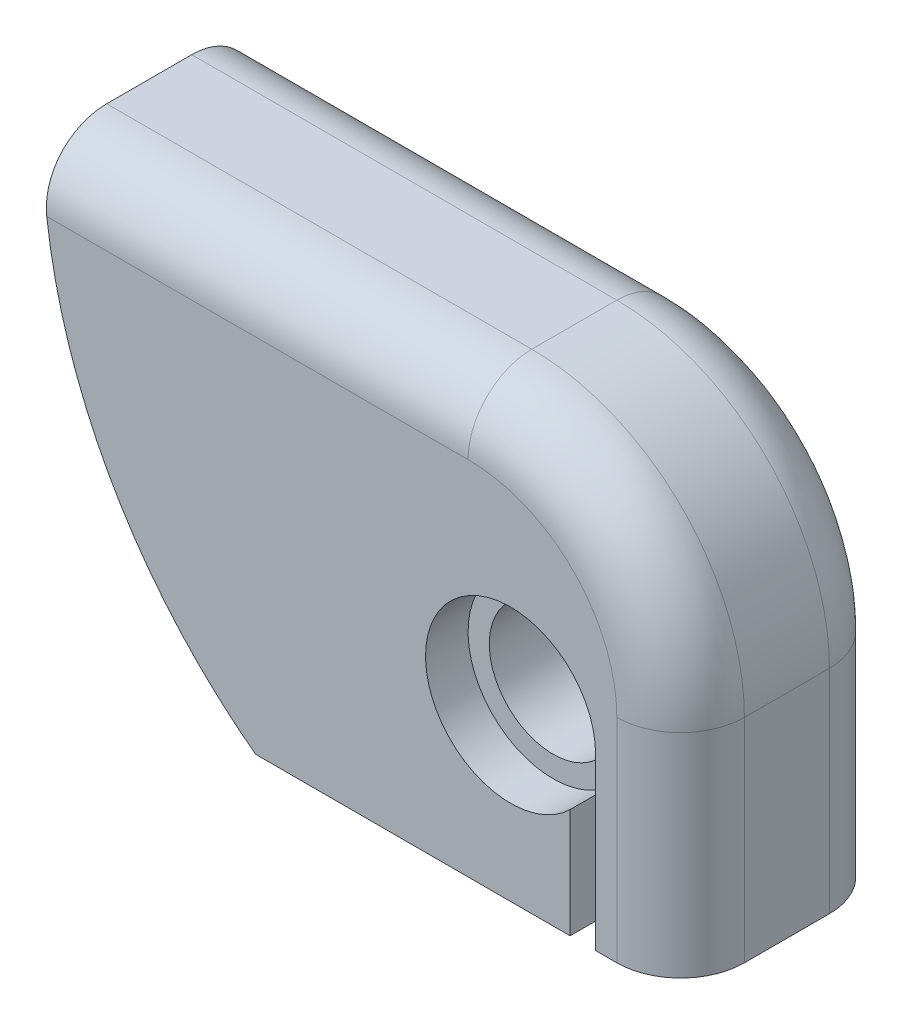
ISO-10303-21;
HEADER;
FILE_DESCRIPTION(('STEP AP214'),'2;1');
FILE_NAME('part.step','',(''),(''),'','','');
FILE_SCHEMA(('AUTOMOTIVE_DESIGN { 1 0 10303 214 1 1 1 1 }'));
ENDSEC;
DATA;
#1=APPLICATION_CONTEXT('core data for automotive mechanical design processes');
#2=APPLICATION_PROTOCOL_DEFINITION('international standard','automotive_design',2000,#1);
#3=PRODUCT_CONTEXT('',#1,'mechanical');
#4=PRODUCT('Part','Part','',(#3));
#5=PRODUCT_RELATED_PRODUCT_CATEGORY('part','',(#4));
#6=PRODUCT_DEFINITION_FORMATION('','',#4);
#7=PRODUCT_DEFINITION_CONTEXT('part definition',#1,'design');
#8=PRODUCT_DEFINITION('design','',#6,#7);
#9=PRODUCT_DEFINITION_SHAPE('','',#8);
#10=(LENGTH_UNIT() NAMED_UNIT(*) SI_UNIT(.MILLI.,.METRE.));
#11=(NAMED_UNIT(*) PLANE_ANGLE_UNIT() SI_UNIT($,.RADIAN.));
#12=(NAMED_UNIT(*) SI_UNIT($,.STERADIAN.) SOLID_ANGLE_UNIT());
#13=UNCERTAINTY_MEASURE_WITH_UNIT(LENGTH_MEASURE(1.E-05),#10,'distance_accuracy_value','');
#14=(GEOMETRIC_REPRESENTATION_CONTEXT(3) GLOBAL_UNCERTAINTY_ASSIGNED_CONTEXT((#13)) GLOBAL_UNIT_ASSIGNED_CONTEXT((#10,
#11,#12)) REPRESENTATION_CONTEXT('',''));
#15=CARTESIAN_POINT('',(0.,0.,0.));
#16=DIRECTION('',(0.,0.,1.));
#17=DIRECTION('',(1.,0.,0.));
#18=AXIS2_PLACEMENT_3D('',#15,#16,#17);
#19=CARTESIAN_POINT('',(-2.49999999999999,10.,2.5));
#20=DIRECTION('',(0.,0.,1.));
#21=DIRECTION('',(1.,0.,0.));
#22=AXIS2_PLACEMENT_3D('',#19,#20,#21);
#23=PLANE('',#22);
#24=DIRECTION('',(1.,0.,0.));
#25=VECTOR('',#24,1.);
#26=CARTESIAN_POINT('',(0.,0.,2.5));
#27=LINE('',#26,#25);
#28=CARTESIAN_POINT('',(-2.,0.,2.5));
#29=VERTEX_POINT('',#28);
#30=CARTESIAN_POINT('',(-1.5,0.,2.5));
#31=VERTEX_POINT('',#30);
#32=EDGE_CURVE('E229',#29,#31,#27,.T.);
#33=ORIENTED_EDGE('',*,*,#32,.T.);
#34=DIRECTION('',(0.,1.,0.));
#35=VECTOR('',#34,1.);
#36=CARTESIAN_POINT('',(-1.5,5.,2.5));
#37=LINE('',#36,#35);
#38=CARTESIAN_POINT('',(-1.5,5.,2.5));
#39=VERTEX_POINT('',#38);
#40=EDGE_CURVE('E253',#31,#39,#37,.T.);
#41=ORIENTED_EDGE('',*,*,#40,.T.);
#42=CARTESIAN_POINT('',(-5.,5.,2.5));
#43=DIRECTION('',(0.,0.,1.));
#44=DIRECTION('',(1.,0.,0.));
#45=AXIS2_PLACEMENT_3D('',#42,#43,#44);
#46=CIRCLE('',#45,3.5);
#47=CARTESIAN_POINT('',(-5.,8.5,2.5));
#48=VERTEX_POINT('',#47);
#49=EDGE_CURVE('E251',#39,#48,#46,.T.);
#50=ORIENTED_EDGE('',*,*,#49,.T.);
#51=DIRECTION('',(-1.,0.,0.));
#52=VECTOR('',#51,1.);
#53=CARTESIAN_POINT('',(-15.,8.5,2.5));
#54=LINE('',#53,#52);
#55=CARTESIAN_POINT('',(-14.9096736459909,8.5,2.5));
#56=VERTEX_POINT('',#55);
#57=EDGE_CURVE('E245',#48,#56,#54,.T.);
#58=ORIENTED_EDGE('',*,*,#57,.T.);
#59=CARTESIAN_POINT('',(-2.49999999999999,10.,2.5));
#60=DIRECTION('',(0.,0.,1.));
#61=DIRECTION('',(1.,0.,0.));
#62=AXIS2_PLACEMENT_3D('',#59,#60,#61);
#63=CIRCLE('',#62,12.5);
#64=CARTESIAN_POINT('',(-10.,0.,2.5));
#65=VERTEX_POINT('',#64);
#66=EDGE_CURVE('E228',#56,#65,#63,.T.);
#67=ORIENTED_EDGE('',*,*,#66,.T.);
#68=CARTESIAN_POINT('',(-2.6,0.,2.5));
#69=VERTEX_POINT('',#68);
#70=EDGE_CURVE('E225',#65,#69,#27,.T.);
#71=ORIENTED_EDGE('',*,*,#70,.T.);
#72=DIRECTION('',(0.,-1.,0.));
#73=VECTOR('',#72,1.);
#74=CARTESIAN_POINT('',(-2.6,-3.09530130898683,2.5));
#75=LINE('',#74,#73);
#76=CARTESIAN_POINT('',(-2.6,2.57171431429143,2.5));
#77=VERTEX_POINT('',#76);
#78=EDGE_CURVE('E170',#77,#69,#75,.T.);
#79=ORIENTED_EDGE('',*,*,#78,.F.);
#80=CARTESIAN_POINT('',(-4.,4.,2.5));
#81=DIRECTION('',(0.,0.,1.));
#82=DIRECTION('',(1.,0.,0.));
#83=AXIS2_PLACEMENT_3D('',#80,#81,#82);
#84=CIRCLE('',#83,2.);
#85=CARTESIAN_POINT('',(-2.,4.,2.5));
#86=VERTEX_POINT('',#85);
#87=EDGE_CURVE('E180',#86,#77,#84,.T.);
#88=ORIENTED_EDGE('',*,*,#87,.F.);
#89=DIRECTION('',(0.,-1.,0.));
#90=VECTOR('',#89,1.);
#91=CARTESIAN_POINT('',(-2.,-3.09530130898683,2.5));
#92=LINE('',#91,#90);
#93=EDGE_CURVE('E155',#86,#29,#92,.T.);
#94=ORIENTED_EDGE('',*,*,#93,.T.);
#95=EDGE_LOOP('',(#33,#41,#50,#58,#67,#71,#79,#88,#94));
#96=FACE_BOUND('',#95,.T.);
#97=ADVANCED_FACE('F32',(#96),#23,.T.);
#98=CARTESIAN_POINT('',(0.,0.,2.5));
#99=DIRECTION('',(0.,1.,0.));
#100=DIRECTION('',(-1.,0.,0.));
#101=AXIS2_PLACEMENT_3D('',#98,#99,#100);
#102=PLANE('',#101);
#103=DIRECTION('',(0.,0.,-1.));
#104=VECTOR('',#103,1.);
#105=CARTESIAN_POINT('',(0.,0.,2.5));
#106=LINE('',#105,#104);
#107=CARTESIAN_POINT('',(0.,0.,1.));
#108=VERTEX_POINT('',#107);
#109=CARTESIAN_POINT('',(0.,0.,-1.));
#110=VERTEX_POINT('',#109);
#111=EDGE_CURVE('E242',#108,#110,#106,.T.);
#112=ORIENTED_EDGE('',*,*,#111,.F.);
#113=CARTESIAN_POINT('',(-1.5,0.,1.));
#114=DIRECTION('',(0.,1.,0.));
#115=DIRECTION('',(-1.,0.,0.));
#116=AXIS2_PLACEMENT_3D('',#113,#114,#115);
#117=CIRCLE('',#116,1.5);
#118=EDGE_CURVE('E262',#108,#31,#117,.F.);
#119=ORIENTED_EDGE('',*,*,#118,.T.);
#120=ORIENTED_EDGE('',*,*,#32,.F.);
#121=DIRECTION('',(0.,0.,1.));
#122=VECTOR('',#121,1.);
#123=CARTESIAN_POINT('',(-2.,0.,1.5));
#124=LINE('',#123,#122);
#125=CARTESIAN_POINT('',(-2.,0.,1.5));
#126=VERTEX_POINT('',#125);
#127=EDGE_CURVE('E184',#126,#29,#124,.T.);
#128=ORIENTED_EDGE('',*,*,#127,.F.);
#129=DIRECTION('',(1.,0.,0.));
#130=VECTOR('',#129,1.);
#131=CARTESIAN_POINT('',(-3.25866302740411,0.,1.5));
#132=LINE('',#131,#130);
#133=CARTESIAN_POINT('',(-2.6,0.,1.5));
#134=VERTEX_POINT('',#133);
#135=EDGE_CURVE('E161',#134,#126,#132,.T.);
#136=ORIENTED_EDGE('',*,*,#135,.F.);
#137=DIRECTION('',(0.,0.,1.));
#138=VECTOR('',#137,1.);
#139=CARTESIAN_POINT('',(-2.6,0.,1.5));
#140=LINE('',#139,#138);
#141=EDGE_CURVE('E187',#134,#69,#140,.T.);
#142=ORIENTED_EDGE('',*,*,#141,.T.);
#143=ORIENTED_EDGE('',*,*,#70,.F.);
#144=DIRECTION('',(0.,0.,-1.));
#145=VECTOR('',#144,1.);
#146=CARTESIAN_POINT('',(-10.,0.,2.5));
#147=LINE('',#146,#145);
#148=CARTESIAN_POINT('',(-10.,0.,-2.5));
#149=VERTEX_POINT('',#148);
#150=EDGE_CURVE('E231',#65,#149,#147,.T.);
#151=ORIENTED_EDGE('',*,*,#150,.T.);
#152=DIRECTION('',(1.,0.,0.));
#153=VECTOR('',#152,1.);
#154=CARTESIAN_POINT('',(0.,0.,-2.5));
#155=LINE('',#154,#153);
#156=CARTESIAN_POINT('',(-2.6,0.,-2.5));
#157=VERTEX_POINT('',#156);
#158=EDGE_CURVE('E232',#149,#157,#155,.T.);
#159=ORIENTED_EDGE('',*,*,#158,.T.);
#160=DIRECTION('',(0.,0.,-1.));
#161=VECTOR('',#160,1.);
#162=CARTESIAN_POINT('',(-2.6,0.,-1.5));
#163=LINE('',#162,#161);
#164=CARTESIAN_POINT('',(-2.6,0.,-1.5));
#165=VERTEX_POINT('',#164);
#166=EDGE_CURVE('E211',#165,#157,#163,.T.);
#167=ORIENTED_EDGE('',*,*,#166,.F.);
#168=DIRECTION('',(1.,0.,0.));
#169=VECTOR('',#168,1.);
#170=CARTESIAN_POINT('',(-3.25866302740411,0.,-1.5));
#171=LINE('',#170,#169);
#172=CARTESIAN_POINT('',(-2.,0.,-1.5));
#173=VERTEX_POINT('',#172);
#174=EDGE_CURVE('E198',#165,#173,#171,.T.);
#175=ORIENTED_EDGE('',*,*,#174,.T.);
#176=DIRECTION('',(0.,0.,-1.));
#177=VECTOR('',#176,1.);
#178=CARTESIAN_POINT('',(-2.,0.,-1.5));
#179=LINE('',#178,#177);
#180=CARTESIAN_POINT('',(-2.,0.,-2.5));
#181=VERTEX_POINT('',#180);
#182=EDGE_CURVE('E201',#173,#181,#179,.T.);
#183=ORIENTED_EDGE('',*,*,#182,.T.);
#184=CARTESIAN_POINT('',(-1.5,0.,-2.5));
#185=VERTEX_POINT('',#184);
#186=EDGE_CURVE('E224',#181,#185,#155,.T.);
#187=ORIENTED_EDGE('',*,*,#186,.T.);
#188=CARTESIAN_POINT('',(-1.5,0.,-1.));
#189=DIRECTION('',(0.,1.,0.));
#190=DIRECTION('',(-1.,0.,0.));
#191=AXIS2_PLACEMENT_3D('',#188,#189,#190);
#192=CIRCLE('',#191,1.5);
#193=EDGE_CURVE('E260',#185,#110,#192,.F.);
#194=ORIENTED_EDGE('',*,*,#193,.T.);
#195=EDGE_LOOP('',(#112,#119,#120,#128,#136,#142,#143,#151,#159,#167,#175,#183,#187,#194));
#196=FACE_BOUND('',#195,.T.);
#197=ADVANCED_FACE('F308',(#196),#102,.F.);
#198=CARTESIAN_POINT('',(-4.,4.,-9.57106781186548));
#199=DIRECTION('',(0.,0.,1.));
#200=DIRECTION('',(1.,0.,0.));
#201=AXIS2_PLACEMENT_3D('',#198,#199,#200);
#202=CYLINDRICAL_SURFACE('',#201,1.5);
#203=CARTESIAN_POINT('',(-4.,4.,-1.5));
#204=DIRECTION('',(0.,0.,1.));
#205=DIRECTION('',(1.,0.,0.));
#206=AXIS2_PLACEMENT_3D('',#203,#204,#205);
#207=CIRCLE('',#206,1.5);
#208=CARTESIAN_POINT('',(-2.5,4.,-1.5));
#209=VERTEX_POINT('',#208);
#210=EDGE_CURVE('E217',#209,#209,#207,.F.);
#211=CARTESIAN_POINT('',(-4.,4.,1.5));
#212=DIRECTION('',(0.,0.,1.));
#213=DIRECTION('',(1.,0.,0.));
#214=AXIS2_PLACEMENT_3D('',#211,#212,#213);
#215=CIRCLE('',#214,1.5);
#216=CARTESIAN_POINT('',(-2.5,4.,1.5));
#217=VERTEX_POINT('',#216);
#218=EDGE_CURVE('E186',#217,#217,#215,.F.);
#219=CARTESIAN_POINT('',(-2.5,4.,-1.5));
#220=CARTESIAN_POINT('',(-2.5,4.,-1.46875));
#221=CARTESIAN_POINT('',(-2.5,4.,-1.4375));
#222=CARTESIAN_POINT('',(-2.5,4.,-1.375));
#223=CARTESIAN_POINT('',(-2.5,4.,-1.34375));
#224=CARTESIAN_POINT('',(-2.5,4.,-1.28125));
#225=CARTESIAN_POINT('',(-2.5,4.,-1.25));
#226=CARTESIAN_POINT('',(-2.5,4.,-1.1875));
#227=CARTESIAN_POINT('',(-2.5,4.,-1.15625));
#228=CARTESIAN_POINT('',(-2.5,4.,-1.09375));
#229=CARTESIAN_POINT('',(-2.5,4.,-1.0625));
#230=CARTESIAN_POINT('',(-2.5,4.,-1.));
#231=CARTESIAN_POINT('',(-2.5,4.,-0.968750000000001));
#232=CARTESIAN_POINT('',(-2.5,4.,-0.906250000000001));
#233=CARTESIAN_POINT('',(-2.5,4.,-0.875000000000001));
#234=CARTESIAN_POINT('',(-2.5,4.,-0.812500000000001));
#235=CARTESIAN_POINT('',(-2.5,4.,-0.781250000000001));
#236=CARTESIAN_POINT('',(-2.5,4.,-0.718750000000001));
#237=CARTESIAN_POINT('',(-2.5,4.,-0.687500000000002));
#238=CARTESIAN_POINT('',(-2.5,4.,-0.625000000000002));
#239=CARTESIAN_POINT('',(-2.5,4.,-0.593750000000002));
#240=CARTESIAN_POINT('',(-2.5,4.,-0.531250000000002));
#241=CARTESIAN_POINT('',(-2.5,4.,-0.500000000000002));
#242=CARTESIAN_POINT('',(-2.5,4.,-0.437500000000002));
#243=CARTESIAN_POINT('',(-2.5,4.,-0.406250000000002));
#244=CARTESIAN_POINT('',(-2.5,4.,-0.343750000000002));
#245=CARTESIAN_POINT('',(-2.5,4.,-0.312500000000002));
#246=CARTESIAN_POINT('',(-2.5,4.,-0.250000000000002));
#247=CARTESIAN_POINT('',(-2.5,4.,-0.218750000000002));
#248=CARTESIAN_POINT('',(-2.5,4.,-0.156250000000002));
#249=CARTESIAN_POINT('',(-2.5,4.,-0.125000000000002));
#250=CARTESIAN_POINT('',(-2.5,4.,-0.0625000000000018));
#251=CARTESIAN_POINT('',(-2.5,4.,-0.0312500000000018));
#252=CARTESIAN_POINT('',(-2.5,4.,0.0312499999999983));
#253=CARTESIAN_POINT('',(-2.5,4.,0.0624999999999983));
#254=CARTESIAN_POINT('',(-2.5,4.,0.124999999999998));
#255=CARTESIAN_POINT('',(-2.5,4.,0.156249999999998));
#256=CARTESIAN_POINT('',(-2.5,4.,0.218749999999998));
#257=CARTESIAN_POINT('',(-2.5,4.,0.249999999999999));
#258=CARTESIAN_POINT('',(-2.5,4.,0.312499999999999));
#259=CARTESIAN_POINT('',(-2.5,4.,0.343749999999999));
#260=CARTESIAN_POINT('',(-2.5,4.,0.406249999999999));
#261=CARTESIAN_POINT('',(-2.5,4.,0.437499999999999));
#262=CARTESIAN_POINT('',(-2.5,4.,0.499999999999998));
#263=CARTESIAN_POINT('',(-2.5,4.,0.531249999999998));
#264=CARTESIAN_POINT('',(-2.5,4.,0.593749999999997));
#265=CARTESIAN_POINT('',(-2.5,4.,0.624999999999997));
#266=CARTESIAN_POINT('',(-2.5,4.,0.687499999999997));
#267=CARTESIAN_POINT('',(-2.5,4.,0.718749999999997));
#268=CARTESIAN_POINT('',(-2.5,4.,0.781249999999997));
#269=CARTESIAN_POINT('',(-2.5,4.,0.812499999999997));
#270=CARTESIAN_POINT('',(-2.5,4.,0.874999999999997));
#271=CARTESIAN_POINT('',(-2.5,4.,0.906249999999997));
#272=CARTESIAN_POINT('',(-2.5,4.,0.968749999999997));
#273=CARTESIAN_POINT('',(-2.5,4.,0.999999999999997));
#274=CARTESIAN_POINT('',(-2.5,4.,1.0625));
#275=CARTESIAN_POINT('',(-2.5,4.,1.09375));
#276=CARTESIAN_POINT('',(-2.5,4.,1.15625));
#277=CARTESIAN_POINT('',(-2.5,4.,1.1875));
#278=CARTESIAN_POINT('',(-2.5,4.,1.25));
#279=CARTESIAN_POINT('',(-2.5,4.,1.28125));
#280=CARTESIAN_POINT('',(-2.5,4.,1.34375));
#281=CARTESIAN_POINT('',(-2.5,4.,1.375));
#282=CARTESIAN_POINT('',(-2.5,4.,1.4375));
#283=CARTESIAN_POINT('',(-2.5,4.,1.46875));
#284=CARTESIAN_POINT('',(-2.5,4.,1.5));
#285=B_SPLINE_CURVE_WITH_KNOTS('',3,(#219,#220,#221,#222,#223,#224,#225,#226,#227,#228,#229,
#230,#231,#232,#233,#234,#235,#236,#237,#238,#239,#240,#241,#242,#243,#244,#245,#246,#247,#248,
#249,#250,#251,#252,#253,#254,#255,#256,#257,#258,#259,#260,#261,#262,#263,#264,#265,#266,#267,
#268,#269,#270,#271,#272,#273,#274,#275,#276,#277,#278,#279,#280,#281,#282,#283,#284),
.UNSPECIFIED.,.F.,.F.,(4,2,2,2,2,2,2,2,2,2,2,2,2,2,2,2,2,2,2,2,2,2,2,2,2,2,2,2,2,2,2,2,4),(0.,
0.0937500000000001,0.1875,0.28125,0.375,0.46875,0.5625,0.656250000000001,0.750000000000001,
0.843749999999999,0.937499999999999,1.03125,1.125,1.21875,1.3125,1.40625,1.5,1.59375,1.6875,
1.78125,1.875,1.96875,2.0625,2.15625,2.25,2.34375,2.4375,2.53125,2.625,2.71875,2.8125,2.90625,
3.),.UNSPECIFIED.);
#286=EDGE_CURVE('BSEAM303',#209,#217,#285,.T.);
#287=ORIENTED_EDGE('',*,*,#210,.T.);
#288=ORIENTED_EDGE('',*,*,#218,.F.);
#289=ORIENTED_EDGE('',*,*,#286,.T.);
#290=ORIENTED_EDGE('',*,*,#286,.F.);
#291=EDGE_LOOP('',(#287,#289,#288,#290));
#292=FACE_BOUND('',#291,.T.);
#293=ADVANCED_FACE('F303',(#292),#202,.F.);
#294=CARTESIAN_POINT('',(0.,10.,2.5));
#295=DIRECTION('',(0.,-1.,0.));
#296=DIRECTION('',(1.,0.,0.));
#297=AXIS2_PLACEMENT_3D('',#294,#295,#296);
#298=PLANE('',#297);
#299=DIRECTION('',(0.,0.,1.));
#300=VECTOR('',#299,1.);
#301=CARTESIAN_POINT('',(-5.,10.,-9.57106781186548));
#302=LINE('',#301,#300);
#303=CARTESIAN_POINT('',(-5.,10.,-1.));
#304=VERTEX_POINT('',#303);
#305=CARTESIAN_POINT('',(-5.,10.,0.999999999999996));
#306=VERTEX_POINT('',#305);
#307=EDGE_CURVE('E218',#304,#306,#302,.T.);
#308=ORIENTED_EDGE('',*,*,#307,.F.);
#309=DIRECTION('',(-1.,0.,0.));
#310=VECTOR('',#309,1.);
#311=CARTESIAN_POINT('',(0.,10.,-1.));
#312=LINE('',#311,#310);
#313=CARTESIAN_POINT('',(-15.,10.,-1.));
#314=VERTEX_POINT('',#313);
#315=EDGE_CURVE('E270',#304,#314,#312,.T.);
#316=ORIENTED_EDGE('',*,*,#315,.T.);
#317=DIRECTION('',(0.,0.,-1.));
#318=VECTOR('',#317,1.);
#319=CARTESIAN_POINT('',(-15.,10.,2.5));
#320=LINE('',#319,#318);
#321=CARTESIAN_POINT('',(-15.,10.,1.));
#322=VERTEX_POINT('',#321);
#323=EDGE_CURVE('E239',#322,#314,#320,.T.);
#324=ORIENTED_EDGE('',*,*,#323,.F.);
#325=DIRECTION('',(-1.,0.,0.));
#326=VECTOR('',#325,1.);
#327=CARTESIAN_POINT('',(-5.,10.,1.));
#328=LINE('',#327,#326);
#329=EDGE_CURVE('E268',#322,#306,#328,.F.);
#330=ORIENTED_EDGE('',*,*,#329,.T.);
#331=EDGE_LOOP('',(#308,#316,#324,#330));
#332=FACE_BOUND('',#331,.T.);
#333=ADVANCED_FACE('F299',(#332),#298,.F.);
#334=CARTESIAN_POINT('',(-2.49999999999999,10.,-2.5));
#335=DIRECTION('',(0.,0.,1.));
#336=DIRECTION('',(1.,0.,0.));
#337=AXIS2_PLACEMENT_3D('',#334,#335,#336);
#338=PLANE('',#337);
#339=CARTESIAN_POINT('',(-2.49999999999999,10.,-2.5));
#340=DIRECTION('',(0.,0.,1.));
#341=DIRECTION('',(1.,0.,0.));
#342=AXIS2_PLACEMENT_3D('',#339,#340,#341);
#343=CIRCLE('',#342,12.5);
#344=CARTESIAN_POINT('',(-14.9096736459909,8.5,-2.5));
#345=VERTEX_POINT('',#344);
#346=EDGE_CURVE('E235',#345,#149,#343,.T.);
#347=ORIENTED_EDGE('',*,*,#346,.F.);
#348=DIRECTION('',(-1.,0.,0.));
#349=VECTOR('',#348,1.);
#350=CARTESIAN_POINT('',(-2.49999999999999,8.5,-2.5));
#351=LINE('',#350,#349);
#352=CARTESIAN_POINT('',(-5.,8.5,-2.5));
#353=VERTEX_POINT('',#352);
#354=EDGE_CURVE('E11',#345,#353,#351,.F.);
#355=ORIENTED_EDGE('',*,*,#354,.T.);
#356=CARTESIAN_POINT('',(-5.,5.,-2.5));
#357=DIRECTION('',(0.,0.,1.));
#358=DIRECTION('',(1.,0.,0.));
#359=AXIS2_PLACEMENT_3D('',#356,#357,#358);
#360=CIRCLE('',#359,3.5);
#361=CARTESIAN_POINT('',(-1.5,5.,-2.5));
#362=VERTEX_POINT('',#361);
#363=EDGE_CURVE('E48',#353,#362,#360,.F.);
#364=ORIENTED_EDGE('',*,*,#363,.T.);
#365=DIRECTION('',(0.,1.,0.));
#366=VECTOR('',#365,1.);
#367=CARTESIAN_POINT('',(-1.5,10.,-2.5));
#368=LINE('',#367,#366);
#369=EDGE_CURVE('E41',#362,#185,#368,.F.);
#370=ORIENTED_EDGE('',*,*,#369,.T.);
#371=ORIENTED_EDGE('',*,*,#186,.F.);
#372=DIRECTION('',(0.,-1.,0.));
#373=VECTOR('',#372,1.);
#374=CARTESIAN_POINT('',(-2.,-3.09530130898683,-2.5));
#375=LINE('',#374,#373);
#376=CARTESIAN_POINT('',(-2.,4.,-2.5));
#377=VERTEX_POINT('',#376);
#378=EDGE_CURVE('E202',#377,#181,#375,.T.);
#379=ORIENTED_EDGE('',*,*,#378,.F.);
#380=CARTESIAN_POINT('',(-4.,4.,-2.5));
#381=DIRECTION('',(0.,0.,1.));
#382=DIRECTION('',(1.,0.,0.));
#383=AXIS2_PLACEMENT_3D('',#380,#381,#382);
#384=CIRCLE('',#383,2.);
#385=CARTESIAN_POINT('',(-2.6,2.57171431429143,-2.5));
#386=VERTEX_POINT('',#385);
#387=EDGE_CURVE('E204',#377,#386,#384,.T.);
#388=ORIENTED_EDGE('',*,*,#387,.T.);
#389=DIRECTION('',(0.,-1.,0.));
#390=VECTOR('',#389,1.);
#391=CARTESIAN_POINT('',(-2.6,-3.09530130898683,-2.5));
#392=LINE('',#391,#390);
#393=EDGE_CURVE('E194',#386,#157,#392,.T.);
#394=ORIENTED_EDGE('',*,*,#393,.T.);
#395=ORIENTED_EDGE('',*,*,#158,.F.);
#396=EDGE_LOOP('',(#347,#355,#364,#370,#371,#379,#388,#394,#395));
#397=FACE_BOUND('',#396,.T.);
#398=ADVANCED_FACE('F297',(#397),#338,.F.);
#399=CARTESIAN_POINT('',(0.,0.,2.5));
#400=DIRECTION('',(-1.,0.,0.));
#401=DIRECTION('',(0.,0.,1.));
#402=AXIS2_PLACEMENT_3D('',#399,#400,#401);
#403=PLANE('',#402);
#404=DIRECTION('',(0.,0.,1.));
#405=VECTOR('',#404,1.);
#406=CARTESIAN_POINT('',(0.,5.,-9.57106781186548));
#407=LINE('',#406,#405);
#408=CARTESIAN_POINT('',(0.,5.,-1.));
#409=VERTEX_POINT('',#408);
#410=CARTESIAN_POINT('',(0.,5.,0.999999999999997));
#411=VERTEX_POINT('',#410);
#412=EDGE_CURVE('E221',#409,#411,#407,.T.);
#413=ORIENTED_EDGE('',*,*,#412,.T.);
#414=DIRECTION('',(0.,1.,0.));
#415=VECTOR('',#414,1.);
#416=CARTESIAN_POINT('',(0.,0.,1.));
#417=LINE('',#416,#415);
#418=EDGE_CURVE('E258',#411,#108,#417,.F.);
#419=ORIENTED_EDGE('',*,*,#418,.T.);
#420=ORIENTED_EDGE('',*,*,#111,.T.);
#421=DIRECTION('',(0.,1.,0.));
#422=VECTOR('',#421,1.);
#423=CARTESIAN_POINT('',(0.,0.,-1.));
#424=LINE('',#423,#422);
#425=EDGE_CURVE('E256',#110,#409,#424,.T.);
#426=ORIENTED_EDGE('',*,*,#425,.T.);
#427=EDGE_LOOP('',(#413,#419,#420,#426));
#428=FACE_BOUND('',#427,.T.);
#429=ADVANCED_FACE('F295',(#428),#403,.F.);
#430=CARTESIAN_POINT('',(-2.49999999999999,10.,2.5));
#431=DIRECTION('',(0.,0.,-1.));
#432=DIRECTION('',(-1.,0.,0.));
#433=AXIS2_PLACEMENT_3D('',#430,#431,#432);
#434=CYLINDRICAL_SURFACE('',#433,12.5);
#435=ORIENTED_EDGE('',*,*,#323,.T.);
#436=CARTESIAN_POINT('',(-15.,10.,-1.));
#437=CARTESIAN_POINT('',(-14.9999987694352,9.99999971856559,-1.04219611734056));
#438=CARTESIAN_POINT('',(-15.0000001383337,9.99821837072552,-1.08437202117825));
#439=CARTESIAN_POINT('',(-14.9999975848447,9.99111184095478,-1.16842213492557));
#440=CARTESIAN_POINT('',(-14.9999936627077,9.9857868268634,-1.21029635902878));
#441=CARTESIAN_POINT('',(-14.9999582652267,9.96454650154868,-1.33494553508898));
#442=CARTESIAN_POINT('',(-14.99990322288,9.94336576944003,-1.41688574305065));
#443=CARTESIAN_POINT('',(-14.9995249841696,9.88755048960332,-1.57604584856594));
#444=CARTESIAN_POINT('',(-14.999201656879,9.85290937740402,-1.65326342164607));
#445=CARTESIAN_POINT('',(-14.9979717340822,9.77116182017292,-1.80078277838428));
#446=CARTESIAN_POINT('',(-14.9970652399698,9.72405754291843,-1.87108576181547));
#447=CARTESIAN_POINT('',(-14.9942955177223,9.61876098275411,-2.00273422854891));
#448=CARTESIAN_POINT('',(-14.992432875184,9.56057550027521,-2.06408516506516));
#449=CARTESIAN_POINT('',(-14.9873719566865,9.43476009824233,-2.17614603928224));
#450=CARTESIAN_POINT('',(-14.9841735003202,9.3671289038276,-2.22685453828776));
#451=CARTESIAN_POINT('',(-14.9761287073568,9.22456936988384,-2.31607617854831));
#452=CARTESIAN_POINT('',(-14.9712862494252,9.14965849940385,-2.35461761604438));
#453=CARTESIAN_POINT('',(-14.9597418772903,8.99458381669196,-2.41859523729839));
#454=CARTESIAN_POINT('',(-14.9530408691311,8.91442257852451,-2.44403778954967));
#455=CARTESIAN_POINT('',(-14.9402624531277,8.77816027575061,-2.47505181424732));
#456=CARTESIAN_POINT('',(-14.9347078923701,8.7228405279878,-2.48440915124254));
#457=CARTESIAN_POINT('',(-14.9227894477094,8.61167154306447,-2.49688279478336));
#458=CARTESIAN_POINT('',(-14.9164267726422,8.55582320977304,-2.50000830906351));
#459=CARTESIAN_POINT('',(-14.9096736459909,8.5,-2.5));
#460=B_SPLINE_CURVE_WITH_KNOTS('',3,(#436,#437,#438,#439,#440,#441,#442,#443,#444,#445,#446,
#447,#448,#449,#450,#451,#452,#453,#454,#455,#456,#457,#458,#459),.UNSPECIFIED.,.F.,.F.,(4,2,2,
2,2,2,2,2,2,2,2,4),(0.,0.126510611846237,0.253015232174578,0.505613512698983,0.758335137402742,
1.01101283390123,1.26353596127422,1.51609320396737,1.76805868624971,2.01990155050728,
2.18870953177601,2.35726790800798),.UNSPECIFIED.);
#461=EDGE_CURVE('E280',#314,#345,#460,.T.);
#462=ORIENTED_EDGE('',*,*,#461,.T.);
#463=ORIENTED_EDGE('',*,*,#346,.T.);
#464=ORIENTED_EDGE('',*,*,#150,.F.);
#465=ORIENTED_EDGE('',*,*,#66,.F.);
#466=CARTESIAN_POINT('',(-14.9096736459909,8.5,2.5));
#467=CARTESIAN_POINT('',(-14.9147355629286,8.5418681377638,2.4999997315655));
#468=CARTESIAN_POINT('',(-14.9195807000652,8.583743057633,2.49824588592708));
#469=CARTESIAN_POINT('',(-14.9288187185416,8.66724869694066,2.49123619950866));
#470=CARTESIAN_POINT('',(-14.9332116004411,8.70887941668129,2.48598036306253));
#471=CARTESIAN_POINT('',(-14.9456709115546,8.83289013453353,2.46498937632729));
#472=CARTESIAN_POINT('',(-14.9530338577697,8.91452046056546,2.44403069883932));
#473=CARTESIAN_POINT('',(-14.9658550455073,9.0732728263069,2.38868256576928));
#474=CARTESIAN_POINT('',(-14.9713119345805,9.15039163268158,2.35428361010879));
#475=CARTESIAN_POINT('',(-14.980482090897,9.29784325688014,2.27299934140793));
#476=CARTESIAN_POINT('',(-14.9841957930538,9.36817776385851,2.22611714743202));
#477=CARTESIAN_POINT('',(-14.9901602690871,9.49977132576756,2.12138498938666));
#478=CARTESIAN_POINT('',(-14.9924164981829,9.56106355239243,2.06357698304008));
#479=CARTESIAN_POINT('',(-14.9958521308622,9.67314866532717,1.93849588425055));
#480=CARTESIAN_POINT('',(-14.9970312934113,9.72393919952064,1.87122067704967));
#481=CARTESIAN_POINT('',(-14.9986916525837,9.81363843738458,1.72899798621909));
#482=CARTESIAN_POINT('',(-14.9991715855331,9.85252552880988,1.65403687327518));
#483=CARTESIAN_POINT('',(-14.9997676640309,9.91717816284269,1.49867361485344));
#484=CARTESIAN_POINT('',(-14.999884009961,9.94295092651168,1.41827449136517));
#485=CARTESIAN_POINT('',(-14.9999804439447,9.97449695071047,1.28118820339051));
#486=CARTESIAN_POINT('',(-14.9999926427159,9.98405393913394,1.22534189799767));
#487=CARTESIAN_POINT('',(-15.0000000314911,9.99680525959181,1.11300471439247));
#488=CARTESIAN_POINT('',(-14.9999952445985,10.0000082249454,1.05651481581382));
#489=CARTESIAN_POINT('',(-15.,10.,1.));
#490=B_SPLINE_CURVE_WITH_KNOTS('',3,(#466,#467,#468,#469,#470,#471,#472,#473,#474,#475,#476,
#477,#478,#479,#480,#481,#482,#483,#484,#485,#486,#487,#488,#489),.UNSPECIFIED.,.F.,.F.,(4,2,2,
2,2,2,2,2,2,2,2,4),(0.,0.126443208411518,0.252886260343721,0.50537924863412,0.758051031981054,
1.01065974185111,1.26231739102248,1.51403134430088,1.76619964260538,2.01822894037389,
2.18786498761149,2.3572703891721),.UNSPECIFIED.);
#491=EDGE_CURVE('E273',#56,#322,#490,.T.);
#492=ORIENTED_EDGE('',*,*,#491,.T.);
#493=EDGE_LOOP('',(#435,#462,#463,#464,#465,#492));
#494=FACE_BOUND('',#493,.T.);
#495=ADVANCED_FACE('F289',(#494),#434,.T.);
#496=CARTESIAN_POINT('',(-5.,5.,-9.57106781186548));
#497=DIRECTION('',(0.,0.,1.));
#498=DIRECTION('',(1.,0.,0.));
#499=AXIS2_PLACEMENT_3D('',#496,#497,#498);
#500=CYLINDRICAL_SURFACE('',#499,5.);
#501=ORIENTED_EDGE('',*,*,#307,.T.);
#502=CARTESIAN_POINT('',(-5.,5.,1.));
#503=DIRECTION('',(0.,0.,1.));
#504=DIRECTION('',(1.,0.,0.));
#505=AXIS2_PLACEMENT_3D('',#502,#503,#504);
#506=CIRCLE('',#505,5.);
#507=EDGE_CURVE('E266',#306,#411,#506,.F.);
#508=ORIENTED_EDGE('',*,*,#507,.T.);
#509=ORIENTED_EDGE('',*,*,#412,.F.);
#510=CARTESIAN_POINT('',(-5.,5.,-0.999999999999997));
#511=DIRECTION('',(0.,0.,1.));
#512=DIRECTION('',(1.,0.,0.));
#513=AXIS2_PLACEMENT_3D('',#510,#511,#512);
#514=CIRCLE('',#513,5.);
#515=EDGE_CURVE('E264',#409,#304,#514,.T.);
#516=ORIENTED_EDGE('',*,*,#515,.T.);
#517=EDGE_LOOP('',(#501,#508,#509,#516));
#518=FACE_BOUND('',#517,.T.);
#519=ADVANCED_FACE('F294',(#518),#500,.T.);
#520=CARTESIAN_POINT('',(-3.25866302740411,-3.09530130898683,-1.5));
#521=DIRECTION('',(0.,0.,1.));
#522=DIRECTION('',(1.,0.,0.));
#523=AXIS2_PLACEMENT_3D('',#520,#521,#522);
#524=PLANE('',#523);
#525=DIRECTION('',(0.,-1.,0.));
#526=VECTOR('',#525,1.);
#527=CARTESIAN_POINT('',(-2.,-3.09530130898683,-1.5));
#528=LINE('',#527,#526);
#529=CARTESIAN_POINT('',(-2.,4.,-1.5));
#530=VERTEX_POINT('',#529);
#531=EDGE_CURVE('E191',#530,#173,#528,.T.);
#532=ORIENTED_EDGE('',*,*,#531,.T.);
#533=ORIENTED_EDGE('',*,*,#174,.F.);
#534=DIRECTION('',(0.,-1.,0.));
#535=VECTOR('',#534,1.);
#536=CARTESIAN_POINT('',(-2.6,-3.09530130898683,-1.5));
#537=LINE('',#536,#535);
#538=CARTESIAN_POINT('',(-2.6,2.57171431429143,-1.5));
#539=VERTEX_POINT('',#538);
#540=EDGE_CURVE('E196',#539,#165,#537,.T.);
#541=ORIENTED_EDGE('',*,*,#540,.F.);
#542=CARTESIAN_POINT('',(-4.,4.,-1.5));
#543=DIRECTION('',(0.,0.,1.));
#544=DIRECTION('',(1.,0.,0.));
#545=AXIS2_PLACEMENT_3D('',#542,#543,#544);
#546=CIRCLE('',#545,2.);
#547=EDGE_CURVE('E193',#530,#539,#546,.T.);
#548=ORIENTED_EDGE('',*,*,#547,.F.);
#549=EDGE_LOOP('',(#532,#533,#541,#548));
#550=FACE_BOUND('',#549,.T.);
#551=ORIENTED_EDGE('',*,*,#210,.F.);
#552=EDGE_LOOP('',(#551));
#553=FACE_BOUND('',#552,.T.);
#554=ADVANCED_FACE('F331',(#550,#553),#524,.F.);
#555=CARTESIAN_POINT('',(-2.,-3.09530130898683,-1.5));
#556=DIRECTION('',(1.,0.,0.));
#557=DIRECTION('',(0.,0.,-1.));
#558=AXIS2_PLACEMENT_3D('',#555,#556,#557);
#559=PLANE('',#558);
#560=ORIENTED_EDGE('',*,*,#378,.T.);
#561=ORIENTED_EDGE('',*,*,#182,.F.);
#562=ORIENTED_EDGE('',*,*,#531,.F.);
#563=DIRECTION('',(0.,0.,-1.));
#564=VECTOR('',#563,1.);
#565=CARTESIAN_POINT('',(-2.,4.,-1.5));
#566=LINE('',#565,#564);
#567=EDGE_CURVE('E215',#530,#377,#566,.T.);
#568=ORIENTED_EDGE('',*,*,#567,.T.);
#569=EDGE_LOOP('',(#560,#561,#562,#568));
#570=FACE_BOUND('',#569,.T.);
#571=ADVANCED_FACE('F336',(#570),#559,.F.);
#572=CARTESIAN_POINT('',(-4.,4.,-1.5));
#573=DIRECTION('',(0.,0.,-1.));
#574=DIRECTION('',(-1.,0.,0.));
#575=AXIS2_PLACEMENT_3D('',#572,#573,#574);
#576=CYLINDRICAL_SURFACE('',#575,2.);
#577=ORIENTED_EDGE('',*,*,#387,.F.);
#578=ORIENTED_EDGE('',*,*,#567,.F.);
#579=ORIENTED_EDGE('',*,*,#547,.T.);
#580=DIRECTION('',(0.,0.,-1.));
#581=VECTOR('',#580,1.);
#582=CARTESIAN_POINT('',(-2.6,2.57171431429143,-1.5));
#583=LINE('',#582,#581);
#584=EDGE_CURVE('E213',#539,#386,#583,.T.);
#585=ORIENTED_EDGE('',*,*,#584,.T.);
#586=EDGE_LOOP('',(#577,#578,#579,#585));
#587=FACE_BOUND('',#586,.T.);
#588=ADVANCED_FACE('F339',(#587),#576,.F.);
#589=CARTESIAN_POINT('',(-2.6,-3.09530130898683,-1.5));
#590=DIRECTION('',(1.,0.,0.));
#591=DIRECTION('',(0.,1.,0.));
#592=AXIS2_PLACEMENT_3D('',#589,#590,#591);
#593=PLANE('',#592);
#594=ORIENTED_EDGE('',*,*,#393,.F.);
#595=ORIENTED_EDGE('',*,*,#584,.F.);
#596=ORIENTED_EDGE('',*,*,#540,.T.);
#597=ORIENTED_EDGE('',*,*,#166,.T.);
#598=EDGE_LOOP('',(#594,#595,#596,#597));
#599=FACE_BOUND('',#598,.T.);
#600=ADVANCED_FACE('F343',(#599),#593,.T.);
#601=CARTESIAN_POINT('',(-3.25866302740411,-3.09530130898683,1.5));
#602=DIRECTION('',(0.,0.,1.));
#603=DIRECTION('',(1.,0.,0.));
#604=AXIS2_PLACEMENT_3D('',#601,#602,#603);
#605=PLANE('',#604);
#606=DIRECTION('',(0.,-1.,0.));
#607=VECTOR('',#606,1.);
#608=CARTESIAN_POINT('',(-2.,-3.09530130898683,1.5));
#609=LINE('',#608,#607);
#610=CARTESIAN_POINT('',(-2.,4.,1.5));
#611=VERTEX_POINT('',#610);
#612=EDGE_CURVE('E152',#611,#126,#609,.T.);
#613=ORIENTED_EDGE('',*,*,#612,.F.);
#614=CARTESIAN_POINT('',(-4.,4.,1.5));
#615=DIRECTION('',(0.,0.,1.));
#616=DIRECTION('',(1.,0.,0.));
#617=AXIS2_PLACEMENT_3D('',#614,#615,#616);
#618=CIRCLE('',#617,2.);
#619=CARTESIAN_POINT('',(-2.6,2.57171431429143,1.5));
#620=VERTEX_POINT('',#619);
#621=EDGE_CURVE('E167',#611,#620,#618,.T.);
#622=ORIENTED_EDGE('',*,*,#621,.T.);
#623=DIRECTION('',(0.,-1.,0.));
#624=VECTOR('',#623,1.);
#625=CARTESIAN_POINT('',(-2.6,-3.09530130898683,1.5));
#626=LINE('',#625,#624);
#627=EDGE_CURVE('E174',#620,#134,#626,.T.);
#628=ORIENTED_EDGE('',*,*,#627,.T.);
#629=ORIENTED_EDGE('',*,*,#135,.T.);
#630=EDGE_LOOP('',(#613,#622,#628,#629));
#631=FACE_BOUND('',#630,.T.);
#632=ORIENTED_EDGE('',*,*,#218,.T.);
#633=EDGE_LOOP('',(#632));
#634=FACE_BOUND('',#633,.T.);
#635=ADVANCED_FACE('F165',(#631,#634),#605,.T.);
#636=CARTESIAN_POINT('',(-2.,-3.09530130898683,1.5));
#637=DIRECTION('',(-1.,0.,0.));
#638=DIRECTION('',(0.,0.,1.));
#639=AXIS2_PLACEMENT_3D('',#636,#637,#638);
#640=PLANE('',#639);
#641=ORIENTED_EDGE('',*,*,#93,.F.);
#642=DIRECTION('',(0.,0.,1.));
#643=VECTOR('',#642,1.);
#644=CARTESIAN_POINT('',(-2.,4.,1.5));
#645=LINE('',#644,#643);
#646=EDGE_CURVE('E149',#611,#86,#645,.T.);
#647=ORIENTED_EDGE('',*,*,#646,.F.);
#648=ORIENTED_EDGE('',*,*,#612,.T.);
#649=ORIENTED_EDGE('',*,*,#127,.T.);
#650=EDGE_LOOP('',(#641,#647,#648,#649));
#651=FACE_BOUND('',#650,.T.);
#652=ADVANCED_FACE('F151',(#651),#640,.T.);
#653=CARTESIAN_POINT('',(-2.6,-3.09530130898683,1.5));
#654=DIRECTION('',(-1.,0.,0.));
#655=DIRECTION('',(0.,-1.,0.));
#656=AXIS2_PLACEMENT_3D('',#653,#654,#655);
#657=PLANE('',#656);
#658=ORIENTED_EDGE('',*,*,#78,.T.);
#659=ORIENTED_EDGE('',*,*,#141,.F.);
#660=ORIENTED_EDGE('',*,*,#627,.F.);
#661=DIRECTION('',(0.,0.,1.));
#662=VECTOR('',#661,1.);
#663=CARTESIAN_POINT('',(-2.6,2.57171431429143,1.5));
#664=LINE('',#663,#662);
#665=EDGE_CURVE('E160',#620,#77,#664,.T.);
#666=ORIENTED_EDGE('',*,*,#665,.T.);
#667=EDGE_LOOP('',(#658,#659,#660,#666));
#668=FACE_BOUND('',#667,.T.);
#669=ADVANCED_FACE('F353',(#668),#657,.F.);
#670=CARTESIAN_POINT('',(-4.,4.,1.5));
#671=DIRECTION('',(0.,0.,1.));
#672=DIRECTION('',(1.,0.,0.));
#673=AXIS2_PLACEMENT_3D('',#670,#671,#672);
#674=CYLINDRICAL_SURFACE('',#673,2.);
#675=ORIENTED_EDGE('',*,*,#87,.T.);
#676=ORIENTED_EDGE('',*,*,#665,.F.);
#677=ORIENTED_EDGE('',*,*,#621,.F.);
#678=ORIENTED_EDGE('',*,*,#646,.T.);
#679=EDGE_LOOP('',(#675,#676,#677,#678));
#680=FACE_BOUND('',#679,.T.);
#681=ADVANCED_FACE('F172',(#680),#674,.F.);
#682=CARTESIAN_POINT('',(-2.49999999999999,8.5,1.));
#683=DIRECTION('',(1.,0.,0.));
#684=DIRECTION('',(0.,1.,0.));
#685=AXIS2_PLACEMENT_3D('',#682,#683,#684);
#686=CYLINDRICAL_SURFACE('',#685,1.5);
#687=ORIENTED_EDGE('',*,*,#491,.F.);
#688=ORIENTED_EDGE('',*,*,#57,.F.);
#689=CARTESIAN_POINT('',(-5.,8.5,1.));
#690=DIRECTION('',(1.,0.,0.));
#691=DIRECTION('',(0.,0.,-1.));
#692=AXIS2_PLACEMENT_3D('',#689,#690,#691);
#693=CIRCLE('',#692,1.5);
#694=EDGE_CURVE('E181',#306,#48,#693,.T.);
#695=ORIENTED_EDGE('',*,*,#694,.F.);
#696=ORIENTED_EDGE('',*,*,#329,.F.);
#697=EDGE_LOOP('',(#687,#688,#695,#696));
#698=FACE_BOUND('',#697,.T.);
#699=ADVANCED_FACE('F286',(#698),#686,.T.);
#700=CARTESIAN_POINT('',(-5.,5.,0.999999999999999));
#701=DIRECTION('',(0.,0.,1.));
#702=DIRECTION('',(1.,0.,0.));
#703=AXIS2_PLACEMENT_3D('',#700,#701,#702);
#704=TOROIDAL_SURFACE('',#703,3.5,1.5);
#705=ORIENTED_EDGE('',*,*,#694,.T.);
#706=ORIENTED_EDGE('',*,*,#49,.F.);
#707=CARTESIAN_POINT('',(-1.5,5.,1.));
#708=DIRECTION('',(0.,-1.,0.));
#709=DIRECTION('',(0.,0.,-1.));
#710=AXIS2_PLACEMENT_3D('',#707,#708,#709);
#711=CIRCLE('',#710,1.5);
#712=EDGE_CURVE('E432',#411,#39,#711,.T.);
#713=ORIENTED_EDGE('',*,*,#712,.F.);
#714=ORIENTED_EDGE('',*,*,#507,.F.);
#715=EDGE_LOOP('',(#705,#706,#713,#714));
#716=FACE_BOUND('',#715,.T.);
#717=ADVANCED_FACE('F314',(#716),#704,.T.);
#718=CARTESIAN_POINT('',(-1.5,10.,1.));
#719=DIRECTION('',(0.,-1.,0.));
#720=DIRECTION('',(0.,0.,-1.));
#721=AXIS2_PLACEMENT_3D('',#718,#719,#720);
#722=CYLINDRICAL_SURFACE('',#721,1.5);
#723=ORIENTED_EDGE('',*,*,#118,.F.);
#724=ORIENTED_EDGE('',*,*,#418,.F.);
#725=ORIENTED_EDGE('',*,*,#712,.T.);
#726=ORIENTED_EDGE('',*,*,#40,.F.);
#727=EDGE_LOOP('',(#723,#724,#725,#726));
#728=FACE_BOUND('',#727,.T.);
#729=ADVANCED_FACE('F312',(#728),#722,.T.);
#730=CARTESIAN_POINT('',(-1.5,0.,-1.));
#731=DIRECTION('',(0.,1.,0.));
#732=DIRECTION('',(0.,0.,1.));
#733=AXIS2_PLACEMENT_3D('',#730,#731,#732);
#734=CYLINDRICAL_SURFACE('',#733,1.5);
#735=ORIENTED_EDGE('',*,*,#193,.F.);
#736=ORIENTED_EDGE('',*,*,#369,.F.);
#737=CARTESIAN_POINT('',(-1.5,5.,-1.));
#738=DIRECTION('',(0.,1.,0.));
#739=DIRECTION('',(0.,0.,1.));
#740=AXIS2_PLACEMENT_3D('',#737,#738,#739);
#741=CIRCLE('',#740,1.5);
#742=EDGE_CURVE('E36',#409,#362,#741,.T.);
#743=ORIENTED_EDGE('',*,*,#742,.F.);
#744=ORIENTED_EDGE('',*,*,#425,.F.);
#745=EDGE_LOOP('',(#735,#736,#743,#744));
#746=FACE_BOUND('',#745,.T.);
#747=ADVANCED_FACE('F34',(#746),#734,.T.);
#748=CARTESIAN_POINT('',(-5.,5.,-0.999999999999999));
#749=DIRECTION('',(0.,0.,1.));
#750=DIRECTION('',(1.,0.,0.));
#751=AXIS2_PLACEMENT_3D('',#748,#749,#750);
#752=TOROIDAL_SURFACE('',#751,3.5,1.5);
#753=ORIENTED_EDGE('',*,*,#742,.T.);
#754=ORIENTED_EDGE('',*,*,#363,.F.);
#755=CARTESIAN_POINT('',(-5.,8.5,-0.999999999999999));
#756=DIRECTION('',(-1.,0.,0.));
#757=DIRECTION('',(0.,0.,1.));
#758=AXIS2_PLACEMENT_3D('',#755,#756,#757);
#759=CIRCLE('',#758,1.5);
#760=EDGE_CURVE('E429',#304,#353,#759,.T.);
#761=ORIENTED_EDGE('',*,*,#760,.F.);
#762=ORIENTED_EDGE('',*,*,#515,.F.);
#763=EDGE_LOOP('',(#753,#754,#761,#762));
#764=FACE_BOUND('',#763,.T.);
#765=ADVANCED_FACE('F404',(#764),#752,.T.);
#766=CARTESIAN_POINT('',(0.,8.5,-1.));
#767=DIRECTION('',(-1.,0.,0.));
#768=DIRECTION('',(0.,-1.,0.));
#769=AXIS2_PLACEMENT_3D('',#766,#767,#768);
#770=CYLINDRICAL_SURFACE('',#769,1.5);
#771=ORIENTED_EDGE('',*,*,#760,.T.);
#772=ORIENTED_EDGE('',*,*,#354,.F.);
#773=ORIENTED_EDGE('',*,*,#461,.F.);
#774=ORIENTED_EDGE('',*,*,#315,.F.);
#775=EDGE_LOOP('',(#771,#772,#773,#774));
#776=FACE_BOUND('',#775,.T.);
#777=ADVANCED_FACE('F413',(#776),#770,.T.);
#778=CLOSED_SHELL('',(#97,#197,#293,#333,#398,#429,#495,#519,#554,#571,#588,#600,#635,#652,#669,
#681,#699,#717,#729,#747,#765,#777));
#779=MANIFOLD_SOLID_BREP('B2',#778);
#780=ADVANCED_BREP_SHAPE_REPRESENTATION('',(#18,#779),#14);
#781=SHAPE_DEFINITION_REPRESENTATION(#9,#780);
ENDSEC;
END-ISO-10303-21;
